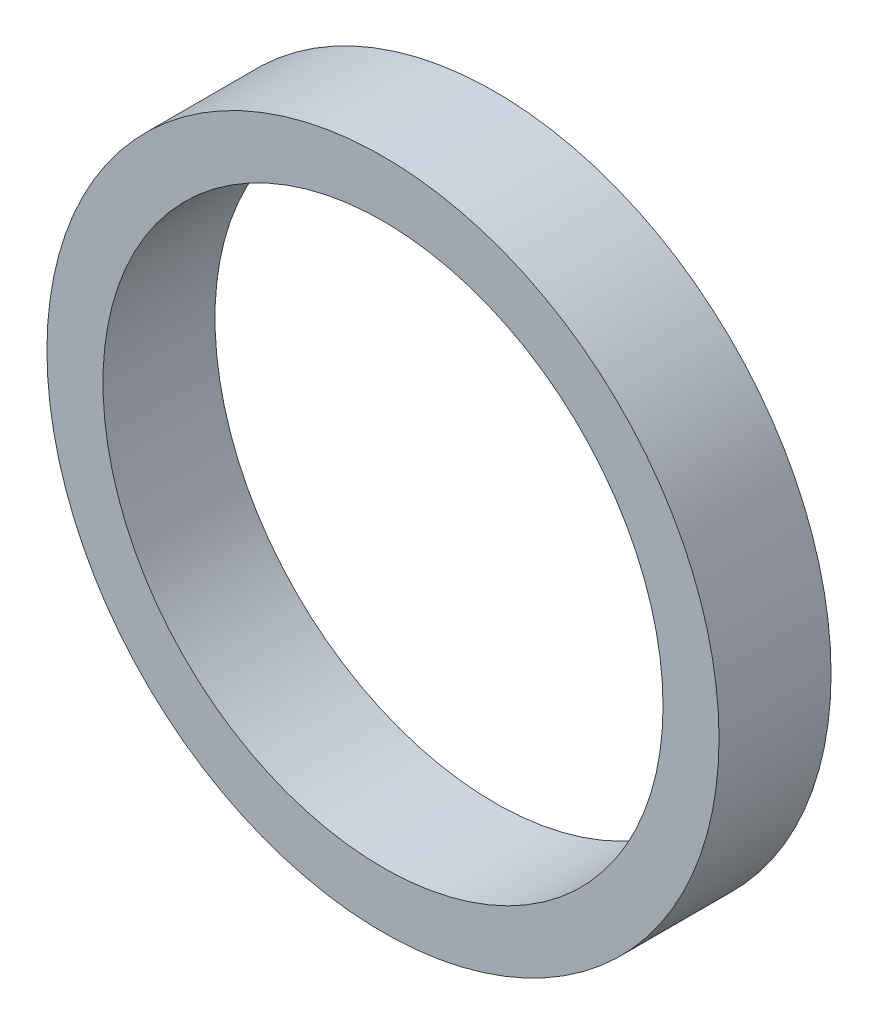
ISO-10303-21;
HEADER;
FILE_DESCRIPTION(('STEP AP214'),'2;1');
FILE_NAME('part.step','',(''),(''),'','','');
FILE_SCHEMA(('AUTOMOTIVE_DESIGN { 1 0 10303 214 1 1 1 1 }'));
ENDSEC;
DATA;
#1=APPLICATION_CONTEXT('core data for automotive mechanical design processes');
#2=APPLICATION_PROTOCOL_DEFINITION('international standard','automotive_design',2000,#1);
#3=PRODUCT_CONTEXT('',#1,'mechanical');
#4=PRODUCT('Part','Part','',(#3));
#5=PRODUCT_RELATED_PRODUCT_CATEGORY('part','',(#4));
#6=PRODUCT_DEFINITION_FORMATION('','',#4);
#7=PRODUCT_DEFINITION_CONTEXT('part definition',#1,'design');
#8=PRODUCT_DEFINITION('design','',#6,#7);
#9=PRODUCT_DEFINITION_SHAPE('','',#8);
#10=(LENGTH_UNIT() NAMED_UNIT(*) SI_UNIT(.MILLI.,.METRE.));
#11=(NAMED_UNIT(*) PLANE_ANGLE_UNIT() SI_UNIT($,.RADIAN.));
#12=(NAMED_UNIT(*) SI_UNIT($,.STERADIAN.) SOLID_ANGLE_UNIT());
#13=UNCERTAINTY_MEASURE_WITH_UNIT(LENGTH_MEASURE(1.E-05),#10,'distance_accuracy_value','');
#14=(GEOMETRIC_REPRESENTATION_CONTEXT(3) GLOBAL_UNCERTAINTY_ASSIGNED_CONTEXT((#13)) GLOBAL_UNIT_ASSIGNED_CONTEXT((#10,
#11,#12)) REPRESENTATION_CONTEXT('',''));
#15=CARTESIAN_POINT('',(0.,0.,0.));
#16=DIRECTION('',(0.,0.,1.));
#17=DIRECTION('',(1.,0.,0.));
#18=AXIS2_PLACEMENT_3D('',#15,#16,#17);
#19=CARTESIAN_POINT('',(0.,0.,10.));
#20=DIRECTION('',(0.,0.,1.));
#21=DIRECTION('',(1.,0.,0.));
#22=AXIS2_PLACEMENT_3D('',#19,#20,#21);
#23=PLANE('',#22);
#24=CARTESIAN_POINT('',(0.,0.,10.));
#25=DIRECTION('',(0.,0.,1.));
#26=DIRECTION('',(1.,0.,0.));
#27=AXIS2_PLACEMENT_3D('',#24,#25,#26);
#28=CIRCLE('',#27,30.);
#29=CARTESIAN_POINT('',(30.,0.,10.));
#30=VERTEX_POINT('',#29);
#31=EDGE_CURVE('E10',#30,#30,#28,.T.);
#32=ORIENTED_EDGE('',*,*,#31,.T.);
#33=EDGE_LOOP('',(#32));
#34=FACE_BOUND('',#33,.T.);
#35=CARTESIAN_POINT('',(0.,0.,10.));
#36=DIRECTION('',(0.,0.,1.));
#37=DIRECTION('',(1.,0.,0.));
#38=AXIS2_PLACEMENT_3D('',#35,#36,#37);
#39=CIRCLE('',#38,25.);
#40=CARTESIAN_POINT('',(25.,0.,10.));
#41=VERTEX_POINT('',#40);
#42=EDGE_CURVE('E50',#41,#41,#39,.T.);
#43=ORIENTED_EDGE('',*,*,#42,.F.);
#44=EDGE_LOOP('',(#43));
#45=FACE_BOUND('',#44,.T.);
#46=ADVANCED_FACE('F37',(#34,#45),#23,.T.);
#47=CARTESIAN_POINT('',(0.,0.,0.));
#48=DIRECTION('',(0.,0.,1.));
#49=DIRECTION('',(1.,0.,0.));
#50=AXIS2_PLACEMENT_3D('',#47,#48,#49);
#51=PLANE('',#50);
#52=CARTESIAN_POINT('',(0.,0.,0.));
#53=DIRECTION('',(0.,0.,1.));
#54=DIRECTION('',(1.,0.,0.));
#55=AXIS2_PLACEMENT_3D('',#52,#53,#54);
#56=CIRCLE('',#55,30.);
#57=CARTESIAN_POINT('',(30.,0.,0.));
#58=VERTEX_POINT('',#57);
#59=EDGE_CURVE('E41',#58,#58,#56,.T.);
#60=ORIENTED_EDGE('',*,*,#59,.F.);
#61=EDGE_LOOP('',(#60));
#62=FACE_BOUND('',#61,.T.);
#63=CARTESIAN_POINT('',(0.,0.,0.));
#64=DIRECTION('',(0.,0.,1.));
#65=DIRECTION('',(1.,0.,0.));
#66=AXIS2_PLACEMENT_3D('',#63,#64,#65);
#67=CIRCLE('',#66,25.);
#68=CARTESIAN_POINT('',(25.,0.,0.));
#69=VERTEX_POINT('',#68);
#70=EDGE_CURVE('E52',#69,#69,#67,.T.);
#71=ORIENTED_EDGE('',*,*,#70,.T.);
#72=EDGE_LOOP('',(#71));
#73=FACE_BOUND('',#72,.T.);
#74=ADVANCED_FACE('F64',(#62,#73),#51,.F.);
#75=CARTESIAN_POINT('',(0.,0.,10.));
#76=DIRECTION('',(0.,0.,-1.));
#77=DIRECTION('',(-1.,0.,0.));
#78=AXIS2_PLACEMENT_3D('',#75,#76,#77);
#79=CYLINDRICAL_SURFACE('',#78,30.);
#80=ORIENTED_EDGE('',*,*,#31,.F.);
#81=EDGE_LOOP('',(#80));
#82=FACE_BOUND('',#81,.T.);
#83=ORIENTED_EDGE('',*,*,#59,.T.);
#84=EDGE_LOOP('',(#83));
#85=FACE_BOUND('',#84,.T.);
#86=ADVANCED_FACE('F39',(#82,#85),#79,.T.);
#87=CARTESIAN_POINT('',(0.,0.,10.));
#88=DIRECTION('',(0.,0.,-1.));
#89=DIRECTION('',(-1.,0.,0.));
#90=AXIS2_PLACEMENT_3D('',#87,#88,#89);
#91=CYLINDRICAL_SURFACE('',#90,25.);
#92=ORIENTED_EDGE('',*,*,#42,.T.);
#93=EDGE_LOOP('',(#92));
#94=FACE_BOUND('',#93,.T.);
#95=ORIENTED_EDGE('',*,*,#70,.F.);
#96=EDGE_LOOP('',(#95));
#97=FACE_BOUND('',#96,.T.);
#98=ADVANCED_FACE('F60',(#94,#97),#91,.F.);
#99=CLOSED_SHELL('',(#46,#74,#86,#98));
#100=MANIFOLD_SOLID_BREP('B2',#99);
#101=ADVANCED_BREP_SHAPE_REPRESENTATION('',(#18,#100),#14);
#102=SHAPE_DEFINITION_REPRESENTATION(#9,#101);
ENDSEC;
END-ISO-10303-21;
